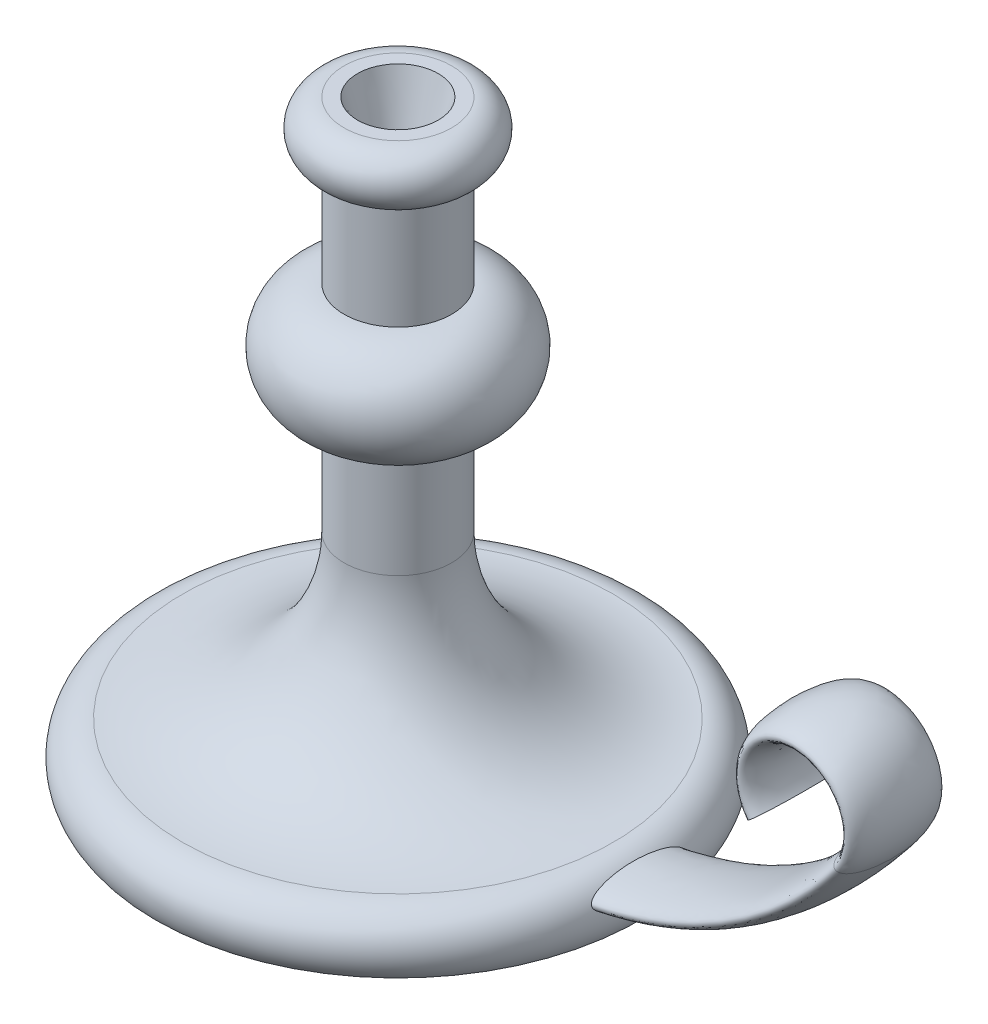
ISO-10303-21;
HEADER;
FILE_DESCRIPTION(('STEP AP214'),'2;1');
FILE_NAME('part.step','',(''),(''),'','','');
FILE_SCHEMA(('AUTOMOTIVE_DESIGN { 1 0 10303 214 1 1 1 1 }'));
ENDSEC;
DATA;
#1=APPLICATION_CONTEXT('core data for automotive mechanical design processes');
#2=APPLICATION_PROTOCOL_DEFINITION('international standard','automotive_design',2000,#1);
#3=PRODUCT_CONTEXT('',#1,'mechanical');
#4=PRODUCT('Part','Part','',(#3));
#5=PRODUCT_RELATED_PRODUCT_CATEGORY('part','',(#4));
#6=PRODUCT_DEFINITION_FORMATION('','',#4);
#7=PRODUCT_DEFINITION_CONTEXT('part definition',#1,'design');
#8=PRODUCT_DEFINITION('design','',#6,#7);
#9=PRODUCT_DEFINITION_SHAPE('','',#8);
#10=(LENGTH_UNIT() NAMED_UNIT(*) SI_UNIT(.MILLI.,.METRE.));
#11=(NAMED_UNIT(*) PLANE_ANGLE_UNIT() SI_UNIT($,.RADIAN.));
#12=(NAMED_UNIT(*) SI_UNIT($,.STERADIAN.) SOLID_ANGLE_UNIT());
#13=UNCERTAINTY_MEASURE_WITH_UNIT(LENGTH_MEASURE(1.E-05),#10,'distance_accuracy_value','');
#14=(GEOMETRIC_REPRESENTATION_CONTEXT(3) GLOBAL_UNCERTAINTY_ASSIGNED_CONTEXT((#13)) GLOBAL_UNIT_ASSIGNED_CONTEXT((#10,
#11,#12)) REPRESENTATION_CONTEXT('',''));
#15=CARTESIAN_POINT('',(0.,0.,0.));
#16=DIRECTION('',(0.,0.,1.));
#17=DIRECTION('',(1.,0.,0.));
#18=AXIS2_PLACEMENT_3D('',#15,#16,#17);
#19=CARTESIAN_POINT('',(90.,0.,0.));
#20=DIRECTION('',(0.,-1.,0.));
#21=DIRECTION('',(0.,0.,-1.));
#22=AXIS2_PLACEMENT_3D('',#19,#20,#21);
#23=PLANE('',#22);
#24=CARTESIAN_POINT('',(0.,0.,0.));
#25=DIRECTION('',(0.,-1.,0.));
#26=DIRECTION('',(0.,0.,-1.));
#27=AXIS2_PLACEMENT_3D('',#24,#25,#26);
#28=CIRCLE('',#27,90.);
#29=CARTESIAN_POINT('',(0.,0.,-90.));
#30=VERTEX_POINT('',#29);
#31=EDGE_CURVE('E77',#30,#30,#28,.T.);
#32=ORIENTED_EDGE('',*,*,#31,.T.);
#33=EDGE_LOOP('',(#32));
#34=FACE_BOUND('',#33,.T.);
#35=ADVANCED_FACE('F37',(#34),#23,.T.);
#36=CARTESIAN_POINT('',(0.,220.,0.));
#37=DIRECTION('',(0.,1.,0.));
#38=DIRECTION('',(0.,0.,1.));
#39=AXIS2_PLACEMENT_3D('',#36,#37,#38);
#40=PLANE('',#39);
#41=CARTESIAN_POINT('',(0.,220.,0.));
#42=DIRECTION('',(0.,1.,0.));
#43=DIRECTION('',(0.,0.,1.));
#44=AXIS2_PLACEMENT_3D('',#41,#42,#43);
#45=CIRCLE('',#44,15.);
#46=CARTESIAN_POINT('',(0.,220.,15.));
#47=VERTEX_POINT('',#46);
#48=EDGE_CURVE('E93',#47,#47,#45,.T.);
#49=ORIENTED_EDGE('',*,*,#48,.F.);
#50=EDGE_LOOP('',(#49));
#51=FACE_BOUND('',#50,.T.);
#52=CARTESIAN_POINT('',(0.,220.,0.));
#53=DIRECTION('',(0.,-1.,0.));
#54=DIRECTION('',(0.,0.,-1.));
#55=AXIS2_PLACEMENT_3D('',#52,#53,#54);
#56=CIRCLE('',#55,20.);
#57=CARTESIAN_POINT('',(0.,220.,-20.));
#58=VERTEX_POINT('',#57);
#59=EDGE_CURVE('E49',#58,#58,#56,.T.);
#60=ORIENTED_EDGE('',*,*,#59,.F.);
#61=EDGE_LOOP('',(#60));
#62=FACE_BOUND('',#61,.T.);
#63=ADVANCED_FACE('F100',(#51,#62),#40,.T.);
#64=CARTESIAN_POINT('',(0.,210.,0.));
#65=DIRECTION('',(0.,-1.,0.));
#66=DIRECTION('',(0.,0.,-1.));
#67=AXIS2_PLACEMENT_3D('',#64,#65,#66);
#68=TOROIDAL_SURFACE('',#67,20.,10.);
#69=ORIENTED_EDGE('',*,*,#59,.T.);
#70=EDGE_LOOP('',(#69));
#71=FACE_BOUND('',#70,.T.);
#72=CARTESIAN_POINT('',(0.,200.,0.));
#73=DIRECTION('',(0.,-1.,0.));
#74=DIRECTION('',(0.,0.,-1.));
#75=AXIS2_PLACEMENT_3D('',#72,#73,#74);
#76=CIRCLE('',#75,20.);
#77=CARTESIAN_POINT('',(0.,200.,-20.));
#78=VERTEX_POINT('',#77);
#79=EDGE_CURVE('E54',#78,#78,#76,.T.);
#80=ORIENTED_EDGE('',*,*,#79,.F.);
#81=EDGE_LOOP('',(#80));
#82=FACE_BOUND('',#81,.T.);
#83=ADVANCED_FACE('F103',(#71,#82),#68,.T.);
#84=CARTESIAN_POINT('',(0.,0.,0.));
#85=DIRECTION('',(0.,-1.,0.));
#86=DIRECTION('',(0.,0.,-1.));
#87=AXIS2_PLACEMENT_3D('',#84,#85,#86);
#88=CYLINDRICAL_SURFACE('',#87,20.);
#89=ORIENTED_EDGE('',*,*,#79,.T.);
#90=EDGE_LOOP('',(#89));
#91=FACE_BOUND('',#90,.T.);
#92=CARTESIAN_POINT('',(0.,160.,0.));
#93=DIRECTION('',(0.,-1.,0.));
#94=DIRECTION('',(0.,0.,-1.));
#95=AXIS2_PLACEMENT_3D('',#92,#93,#94);
#96=CIRCLE('',#95,20.);
#97=CARTESIAN_POINT('',(0.,160.,-20.));
#98=VERTEX_POINT('',#97);
#99=EDGE_CURVE('E59',#98,#98,#96,.T.);
#100=ORIENTED_EDGE('',*,*,#99,.F.);
#101=EDGE_LOOP('',(#100));
#102=FACE_BOUND('',#101,.T.);
#103=ADVANCED_FACE('F108',(#91,#102),#88,.T.);
#104=CARTESIAN_POINT('',(0.,140.,0.));
#105=DIRECTION('',(0.,-1.,0.));
#106=DIRECTION('',(0.,0.,-1.));
#107=AXIS2_PLACEMENT_3D('',#104,#105,#106);
#108=TOROIDAL_SURFACE('',#107,20.,20.);
#109=ORIENTED_EDGE('',*,*,#99,.T.);
#110=EDGE_LOOP('',(#109));
#111=FACE_BOUND('',#110,.T.);
#112=CARTESIAN_POINT('',(0.,120.,0.));
#113=DIRECTION('',(0.,-1.,0.));
#114=DIRECTION('',(0.,0.,-1.));
#115=AXIS2_PLACEMENT_3D('',#112,#113,#114);
#116=CIRCLE('',#115,20.);
#117=CARTESIAN_POINT('',(0.,120.,-20.));
#118=VERTEX_POINT('',#117);
#119=EDGE_CURVE('E65',#118,#118,#116,.T.);
#120=ORIENTED_EDGE('',*,*,#119,.F.);
#121=EDGE_LOOP('',(#120));
#122=FACE_BOUND('',#121,.T.);
#123=ADVANCED_FACE('F114',(#111,#122),#108,.T.);
#124=CARTESIAN_POINT('',(0.,0.,0.));
#125=DIRECTION('',(0.,-1.,0.));
#126=DIRECTION('',(0.,0.,-1.));
#127=AXIS2_PLACEMENT_3D('',#124,#125,#126);
#128=CYLINDRICAL_SURFACE('',#127,20.);
#129=ORIENTED_EDGE('',*,*,#119,.T.);
#130=EDGE_LOOP('',(#129));
#131=FACE_BOUND('',#130,.T.);
#132=CARTESIAN_POINT('',(0.,80.,0.));
#133=DIRECTION('',(0.,-1.,0.));
#134=DIRECTION('',(0.,0.,-1.));
#135=AXIS2_PLACEMENT_3D('',#132,#133,#134);
#136=CIRCLE('',#135,20.);
#137=CARTESIAN_POINT('',(0.,80.,-20.));
#138=VERTEX_POINT('',#137);
#139=EDGE_CURVE('E69',#138,#138,#136,.T.);
#140=ORIENTED_EDGE('',*,*,#139,.F.);
#141=EDGE_LOOP('',(#140));
#142=FACE_BOUND('',#141,.T.);
#143=ADVANCED_FACE('F118',(#131,#142),#128,.T.);
#144=CARTESIAN_POINT('',(0.,80.,0.));
#145=DIRECTION('',(0.,-1.,0.));
#146=DIRECTION('',(0.,0.,-1.));
#147=AXIS2_PLACEMENT_3D('',#144,#145,#146);
#148=TOROIDAL_SURFACE('',#147,80.,60.);
#149=ORIENTED_EDGE('',*,*,#139,.T.);
#150=EDGE_LOOP('',(#149));
#151=FACE_BOUND('',#150,.T.);
#152=CARTESIAN_POINT('',(0.,20.,0.));
#153=DIRECTION('',(0.,-1.,0.));
#154=DIRECTION('',(0.,0.,-1.));
#155=AXIS2_PLACEMENT_3D('',#152,#153,#154);
#156=CIRCLE('',#155,80.);
#157=CARTESIAN_POINT('',(0.,20.,-80.));
#158=VERTEX_POINT('',#157);
#159=EDGE_CURVE('E73',#158,#158,#156,.T.);
#160=ORIENTED_EDGE('',*,*,#159,.F.);
#161=EDGE_LOOP('',(#160));
#162=FACE_BOUND('',#161,.T.);
#163=ADVANCED_FACE('F122',(#151,#162),#148,.F.);
#164=CARTESIAN_POINT('',(0.,7.50000000000001,0.));
#165=DIRECTION('',(0.,-1.,0.));
#166=DIRECTION('',(0.,0.,-1.));
#167=AXIS2_PLACEMENT_3D('',#164,#165,#166);
#168=TOROIDAL_SURFACE('',#167,80.,12.5);
#169=CARTESIAN_POINT('',(89.5597422043342,12.9414346567555,17.5));
#170=CARTESIAN_POINT('',(89.5807278946485,12.8988393157081,17.5000019534777));
#171=CARTESIAN_POINT('',(89.6018125795404,12.8563039357769,17.4977816975197));
#172=CARTESIAN_POINT('',(89.6440155813562,12.7716938339371,17.489002543543));
#173=CARTESIAN_POINT('',(89.6651339056646,12.7296192360718,17.4824425050804));
#174=CARTESIAN_POINT('',(89.7283289297819,12.6045076597417,17.4565216692095));
#175=CARTESIAN_POINT('',(89.7702246464786,12.5226255894255,17.4309204730636));
#176=CARTESIAN_POINT('',(89.8644276523312,12.3407735771966,17.3563532007827));
#177=CARTESIAN_POINT('',(89.916211748319,12.242484901666,17.3027527423027));
#178=CARTESIAN_POINT('',(90.01638786814,12.0551458272008,17.178826321144));
#179=CARTESIAN_POINT('',(90.0647710548456,11.966119226993,17.1084587296403));
#180=CARTESIAN_POINT('',(90.1524531790238,11.806984522925,16.9652391551481));
#181=CARTESIAN_POINT('',(90.1921458014335,11.7358878994478,16.8936963434585));
#182=CARTESIAN_POINT('',(90.2690886261224,11.5996259068224,16.7438969488311));
#183=CARTESIAN_POINT('',(90.3063367280021,11.5344656201533,16.665634722265));
#184=CARTESIAN_POINT('',(90.3786756485819,11.4092540815106,16.5039763875565));
#185=CARTESIAN_POINT('',(90.4137624747614,11.349212210629,16.4205713158719));
#186=CARTESIAN_POINT('',(90.4819450166471,11.2336894025402,16.2499454917114));
#187=CARTESIAN_POINT('',(90.5150413047902,11.1782071523835,16.162725848809));
#188=CARTESIAN_POINT('',(90.5839705930101,11.063725182569,15.9728919395737));
#189=CARTESIAN_POINT('',(90.6195406839562,11.0053156128849,15.8698282905888));
#190=CARTESIAN_POINT('',(90.6886668526269,10.8929143897208,15.6606649910659));
#191=CARTESIAN_POINT('',(90.7222226971281,10.8389232475745,15.5545649910506));
#192=CARTESIAN_POINT('',(90.7874864861339,10.7348751403119,15.3401290691865));
#193=CARTESIAN_POINT('',(90.8191972688173,10.6848120890841,15.2317969483067));
#194=CARTESIAN_POINT('',(90.881005962979,10.5880683385414,15.0131968985225));
#195=CARTESIAN_POINT('',(90.9111039714558,10.5413874357517,14.9029290865687));
#196=CARTESIAN_POINT('',(90.9798973633521,10.4355491517099,14.6427529331226));
#197=CARTESIAN_POINT('',(91.0180072010883,10.377593665576,14.4922012075481));
#198=CARTESIAN_POINT('',(91.0918875553169,10.2663462891692,14.1888070722871));
#199=CARTESIAN_POINT('',(91.1276577411367,10.2130550577559,14.0359643425398));
#200=CARTESIAN_POINT('',(91.1971197458645,10.1105127689612,13.7282685712582));
#201=CARTESIAN_POINT('',(91.2308091946811,10.0612662985098,13.573413471871));
#202=CARTESIAN_POINT('',(91.2962483962878,9.966420445748,13.262180104172));
#203=CARTESIAN_POINT('',(91.3279980241889,9.92082129819994,13.1058017385396));
#204=CARTESIAN_POINT('',(91.4205951755327,9.78887458660799,12.6346162266685));
#205=CARTESIAN_POINT('',(91.4787589060981,9.70742476979596,12.3179025042442));
#206=CARTESIAN_POINT('',(91.5890957852254,9.55493826130153,11.6792188898602));
#207=CARTESIAN_POINT('',(91.641236506382,9.48395741425907,11.357230318611));
#208=CARTESIAN_POINT('',(91.7397682682944,9.35136221163198,10.7107316640823));
#209=CARTESIAN_POINT('',(91.7861636672357,9.28974074823248,10.3862236929834));
#210=CARTESIAN_POINT('',(91.873697660451,9.17463718318055,9.73512886653574));
#211=CARTESIAN_POINT('',(91.9148370779327,9.12115380666538,9.4085423451682));
#212=CARTESIAN_POINT('',(91.9930777751443,9.0203120992032,8.74630339912618));
#213=CARTESIAN_POINT('',(92.0300669877613,8.97311921137161,8.41061269264342));
#214=CARTESIAN_POINT('',(92.0991833927575,8.88559842477435,7.73783252743949));
#215=CARTESIAN_POINT('',(92.1313104056235,8.84527077946753,7.40074301754616));
#216=CARTESIAN_POINT('',(92.1909161961866,8.77092313439269,6.7253714235535));
#217=CARTESIAN_POINT('',(92.2183937480205,8.73690479789184,6.38708904887196));
#218=CARTESIAN_POINT('',(92.2688480816039,8.67476840304502,5.70964427774295));
#219=CARTESIAN_POINT('',(92.2918247141674,8.64665054027194,5.37048185250303));
#220=CARTESIAN_POINT('',(92.3540877228586,8.57076604630489,4.35367181244673));
#221=CARTESIAN_POINT('',(92.3868571977359,8.53128338370556,3.67498389641651));
#222=CARTESIAN_POINT('',(92.4356134743347,8.47274161832897,2.31614711504074));
#223=CARTESIAN_POINT('',(92.4515998737814,8.45368300509717,1.63599821506828));
#224=CARTESIAN_POINT('',(92.4661200478782,8.43637339284856,0.357955102331981));
#225=CARTESIAN_POINT('',(92.4665389208555,8.43587490179708,-0.239888856143625));
#226=CARTESIAN_POINT('',(92.4546362797528,8.45006241260831,-1.43536153859162));
#227=CARTESIAN_POINT('',(92.4423128974783,8.46475064105846,-2.0329902181484));
#228=CARTESIAN_POINT('',(92.4047541650815,8.50976680779931,-3.22745109478543));
#229=CARTESIAN_POINT('',(92.3795147316879,8.54009969200439,-3.82428298010724));
#230=CARTESIAN_POINT('',(92.3157217367252,8.61743320229677,-5.01694606233261));
#231=CARTESIAN_POINT('',(92.2771508465328,8.6644555239592,-5.61277493756131));
#232=CARTESIAN_POINT('',(92.1861026743767,8.77678784246257,-6.80153886380941));
#233=CARTESIAN_POINT('',(92.1336290020919,8.84209309262499,-7.39447462535093));
#234=CARTESIAN_POINT('',(92.0437550848418,8.95574227206712,-8.28055229820515));
#235=CARTESIAN_POINT('',(92.0119455213755,8.99622894552015,-8.57528682166729));
#236=CARTESIAN_POINT('',(91.9444204496405,9.0829153979489,-9.16346094428887));
#237=CARTESIAN_POINT('',(91.9087051114865,9.1291149281146,-9.45690059926718));
#238=CARTESIAN_POINT('',(91.8331309715697,9.2278292933407,-10.0422906036684));
#239=CARTESIAN_POINT('',(91.7932707518514,9.28034629056384,-10.3342404073468));
#240=CARTESIAN_POINT('',(91.7091179167369,9.39245062081632,-10.9161852811053));
#241=CARTESIAN_POINT('',(91.6648247441272,9.45203884286032,-11.2061801005453));
#242=CARTESIAN_POINT('',(91.5713925727481,9.57931645333882,-11.7838191658169));
#243=CARTESIAN_POINT('',(91.5222504482681,9.64701107336927,-12.0714617643073));
#244=CARTESIAN_POINT('',(91.4186796874406,9.79172730085908,-12.6430805537632));
#245=CARTESIAN_POINT('',(91.3642572573635,9.86873798424097,-12.9270606150355));
#246=CARTESIAN_POINT('',(91.2493765391174,10.033952974788,-13.4904217181466));
#247=CARTESIAN_POINT('',(91.1889212109096,10.1221517983454,-13.7698049377448));
#248=CARTESIAN_POINT('',(91.0929373870873,10.2648274882363,-14.1839125047647));
#249=CARTESIAN_POINT('',(91.0600757486262,10.314090418185,-14.3210581267387));
#250=CARTESIAN_POINT('',(90.9923938569386,10.4165511027192,-14.593376347765));
#251=CARTESIAN_POINT('',(90.9575737807135,10.4697485018484,-14.7285491237345));
#252=CARTESIAN_POINT('',(90.8810851838775,10.5878451344079,-15.0138774923678));
#253=CARTESIAN_POINT('',(90.8391147723957,10.6533666208412,-15.1636969104749));
#254=CARTESIAN_POINT('',(90.7519625692612,10.7912189771816,-15.4593295355901));
#255=CARTESIAN_POINT('',(90.7067794219568,10.8635527258308,-15.6051410149849));
#256=CARTESIAN_POINT('',(90.6128939496974,11.0160439629677,-15.8905749729623));
#257=CARTESIAN_POINT('',(90.5642084544311,11.0961646105686,-16.0302224467125));
#258=CARTESIAN_POINT('',(90.4624897667354,11.2662530107873,-16.3016394850687));
#259=CARTESIAN_POINT('',(90.4094613083908,11.3562100760682,-16.4334173639364));
#260=CARTESIAN_POINT('',(90.3114276481006,11.5255085385048,-16.6553108138959));
#261=CARTESIAN_POINT('',(90.2675273757817,11.6022608890606,-16.747864447136));
#262=CARTESIAN_POINT('',(90.1761749534326,11.7643292238687,-16.9236630994731));
#263=CARTESIAN_POINT('',(90.1287172073378,11.849658775493,-17.0068929161981));
#264=CARTESIAN_POINT('',(90.0292807633426,12.0313291797368,-17.160728121925));
#265=CARTESIAN_POINT('',(89.9772518064337,12.1277974407354,-17.2311575389091));
#266=CARTESIAN_POINT('',(89.8965437818878,12.2800613987942,-17.3212876850735));
#267=CARTESIAN_POINT('',(89.8692277989253,12.3320164153137,-17.3487242132161));
#268=CARTESIAN_POINT('',(89.8138320311431,12.4382955168478,-17.397521114568));
#269=CARTESIAN_POINT('',(89.7857527202501,12.4926181439798,-17.4188851676711));
#270=CARTESIAN_POINT('',(89.7185869780335,12.6237048005599,-17.4611772226903));
#271=CARTESIAN_POINT('',(89.6792533408886,12.7013692224277,-17.4790502108363));
#272=CARTESIAN_POINT('',(89.6005512815564,12.8586256339485,-17.4997317533413));
#273=CARTESIAN_POINT('',(89.5611829132233,12.9382160139949,-17.5025524785485));
#274=CARTESIAN_POINT('',(89.4835317885697,13.0969633423244,-17.4927372657774));
#275=CARTESIAN_POINT('',(89.4452490812936,13.1761202708964,-17.4801006306501));
#276=CARTESIAN_POINT('',(89.3707047667355,13.3318071774563,-17.440649407729));
#277=CARTESIAN_POINT('',(89.3344452993771,13.4083343423531,-17.4138201116179));
#278=CARTESIAN_POINT('',(89.2510611220235,13.5858554385683,-17.3357126521072));
#279=CARTESIAN_POINT('',(89.2050998650831,13.684982377722,-17.2790047620841));
#280=CARTESIAN_POINT('',(89.1180744174556,13.874427631182,-17.1491670423826));
#281=CARTESIAN_POINT('',(89.0770301058259,13.9647099356686,-17.0759737821298));
#282=CARTESIAN_POINT('',(89.0037033744711,14.1271434857571,-16.927057730704));
#283=CARTESIAN_POINT('',(88.9709541551903,14.2001945680732,-16.8525208708986));
#284=CARTESIAN_POINT('',(88.908496842619,14.3401811690449,-16.6970292692111));
#285=CARTESIAN_POINT('',(88.8787841266134,14.4071259665769,-16.6160846261893));
#286=CARTESIAN_POINT('',(88.8217814388549,14.5359995630883,-16.4490709627678));
#287=CARTESIAN_POINT('',(88.7944998605827,14.5979109242412,-16.362985782321));
#288=CARTESIAN_POINT('',(88.7420667437369,14.717173406466,-16.1870697873631));
#289=CARTESIAN_POINT('',(88.7169159331092,14.7745229686601,-16.0972377082951));
#290=CARTESIAN_POINT('',(88.6682699235336,14.8855899090512,-15.9140699306463));
#291=CARTESIAN_POINT('',(88.6447869137156,14.9392804489426,-15.8207148279059));
#292=CARTESIAN_POINT('',(88.5993971939427,15.0431008843882,-15.6316626961433));
#293=CARTESIAN_POINT('',(88.5774907604158,15.0932301555102,-15.5359652603525));
#294=CARTESIAN_POINT('',(88.513751478622,15.2390285874186,-15.2458062448787));
#295=CARTESIAN_POINT('',(88.4739596847913,15.3299685477359,-15.0485147207848));
#296=CARTESIAN_POINT('',(88.3985337506615,15.5017775203626,-14.6487152633388));
#297=CARTESIAN_POINT('',(88.3629029634839,15.5826384140041,-14.4462032813474));
#298=CARTESIAN_POINT('',(88.2948356711212,15.7363066128672,-14.036576470169));
#299=CARTESIAN_POINT('',(88.2624142295169,15.8090761199816,-13.829445054535));
#300=CARTESIAN_POINT('',(88.2003835751381,15.9473648801957,-13.412628987176));
#301=CARTESIAN_POINT('',(88.1707714189814,16.0128917338223,-13.2029472733582));
#302=CARTESIAN_POINT('',(88.1139049361937,16.1377375745621,-12.78149499463));
#303=CARTESIAN_POINT('',(88.0866500408508,16.1970580597504,-12.5697249473627));
#304=CARTESIAN_POINT('',(88.0276172572029,16.3244235662305,-12.0912931700777));
#305=CARTESIAN_POINT('',(87.9964138193044,16.3909381265495,-11.8241540502343));
#306=CARTESIAN_POINT('',(87.9367717636617,16.5165936764721,-11.2878278414647));
#307=CARTESIAN_POINT('',(87.9083334164421,16.5757339447661,-11.0186405549271));
#308=CARTESIAN_POINT('',(87.8539266282972,16.6875098948958,-10.478540842488));
#309=CARTESIAN_POINT('',(87.8279593730487,16.7401424577996,-10.207627654319));
#310=CARTESIAN_POINT('',(87.7783184309331,16.8395301522937,-9.66451167999793));
#311=CARTESIAN_POINT('',(87.7546448506396,16.8862850108119,-9.39230883453888));
#312=CARTESIAN_POINT('',(87.6869994555324,17.0182803050949,-8.5757896592175));
#313=CARTESIAN_POINT('',(87.6462388525846,17.0955854003688,-8.02991167225412));
#314=CARTESIAN_POINT('',(87.5728065515611,17.2320145687303,-6.93552385093954));
#315=CARTESIAN_POINT('',(87.5401330675682,17.2911426566328,-6.3870146249804));
#316=CARTESIAN_POINT('',(87.4828441952971,17.3930876120975,-5.2895588485085));
#317=CARTESIAN_POINT('',(87.458207458868,17.4359477429323,-4.74061740412501));
#318=CARTESIAN_POINT('',(87.4169410999172,17.5068884934702,-3.64146108218688));
#319=CARTESIAN_POINT('',(87.4003119088602,17.5349683167839,-3.09124613761779));
#320=CARTESIAN_POINT('',(87.3751699481989,17.5771566462025,-1.98980868969207));
#321=CARTESIAN_POINT('',(87.3666614689743,17.5912577671532,-1.43858580772119));
#322=CARTESIAN_POINT('',(87.3578539704596,17.6058511840596,-0.335909067645513));
#323=CARTESIAN_POINT('',(87.3575547550007,17.6063438052041,0.215544784625117));
#324=CARTESIAN_POINT('',(87.3651677510508,17.5937352162513,1.31815822776222));
#325=CARTESIAN_POINT('',(87.3730787250644,17.5806360547996,1.86931785045072));
#326=CARTESIAN_POINT('',(87.3970372477742,17.5404868292747,2.97097544677701));
#327=CARTESIAN_POINT('',(87.4130850653538,17.513436304176,3.52147339794715));
#328=CARTESIAN_POINT('',(87.4531996813081,17.4446213827576,4.62112135666769));
#329=CARTESIAN_POINT('',(87.4772644593791,17.402860693302,5.1702716687412));
#330=CARTESIAN_POINT('',(87.5333316774061,17.3033707612731,6.2667005362351));
#331=CARTESIAN_POINT('',(87.5653334299481,17.2456429015516,6.8139792495936));
#332=CARTESIAN_POINT('',(87.6208220531231,17.1429049509084,7.65503321383743));
#333=CARTESIAN_POINT('',(87.641467966926,17.104233324674,7.9497802880887));
#334=CARTESIAN_POINT('',(87.6851649593456,17.0212250701554,8.5382946276221));
#335=CARTESIAN_POINT('',(87.7082159678751,16.9768886069427,8.83206192119887));
#336=CARTESIAN_POINT('',(87.7568106691337,16.8820510369679,9.4182719723688));
#337=CARTESIAN_POINT('',(87.7823533406001,16.8315524537745,9.7107152216483));
#338=CARTESIAN_POINT('',(87.8360989952265,16.7237193681049,10.2940938312751));
#339=CARTESIAN_POINT('',(87.8643018909557,16.6663850902741,10.5850292408476));
#340=CARTESIAN_POINT('',(87.9147712499547,16.5622842610504,11.0784529887224));
#341=CARTESIAN_POINT('',(87.9362980252954,16.517469189979,11.2814293835336));
#342=CARTESIAN_POINT('',(87.9809118301304,16.4236835134751,11.6862455623077));
#343=CARTESIAN_POINT('',(88.0039988123353,16.3747130339803,11.8880853805192));
#344=CARTESIAN_POINT('',(88.0519198244943,16.272121538476,12.2905621648844));
#345=CARTESIAN_POINT('',(88.0767553337324,16.218496575543,12.4911979528414));
#346=CARTESIAN_POINT('',(88.1283787004668,16.1060707847339,12.8907612736838));
#347=CARTESIAN_POINT('',(88.1551664933022,16.0472701282664,13.089688862902));
#348=CARTESIAN_POINT('',(88.2109999780504,15.9237718205576,13.485420123141));
#349=CARTESIAN_POINT('',(88.2400459194858,15.8590735174965,13.682223556701));
#350=CARTESIAN_POINT('',(88.3008027999433,15.7228691935853,14.0730419872897));
#351=CARTESIAN_POINT('',(88.3325134779584,15.6513638393844,14.2670572552401));
#352=CARTESIAN_POINT('',(88.399142454196,15.5003948115859,14.6511973591138));
#353=CARTESIAN_POINT('',(88.4340575115816,15.4209391715426,14.8413258930661));
#354=CARTESIAN_POINT('',(88.5079196083049,15.2523848762565,15.2164401400171));
#355=CARTESIAN_POINT('',(88.546864811413,15.1632906117649,15.4014281468493));
#356=CARTESIAN_POINT('',(88.6092096238852,15.0206579718869,15.6733114229644));
#357=CARTESIAN_POINT('',(88.6306485895102,14.9716086740024,15.7630166800372));
#358=CARTESIAN_POINT('',(88.6750422753313,14.8701248615221,15.9401002079374));
#359=CARTESIAN_POINT('',(88.6979967332497,14.8176909327198,16.02747887776));
#360=CARTESIAN_POINT('',(88.7456840101799,14.7089478844274,16.1993887567134));
#361=CARTESIAN_POINT('',(88.770417968827,14.6526362825892,16.2839180892543));
#362=CARTESIAN_POINT('',(88.8219484857479,14.5356422617905,16.4492391224753));
#363=CARTESIAN_POINT('',(88.8487445345048,14.4749609227744,16.530031738603));
#364=CARTESIAN_POINT('',(88.8976102788187,14.3647434848949,16.666716843305));
#365=CARTESIAN_POINT('',(88.919137419161,14.316323032208,16.7236955334945));
#366=CARTESIAN_POINT('',(88.9637080676469,14.2164452982158,16.8342912802673));
#367=CARTESIAN_POINT('',(88.9867519478514,14.1649872721063,16.8879075056817));
#368=CARTESIAN_POINT('',(89.0583610181501,14.0058008216797,17.0423310846555));
#369=CARTESIAN_POINT('',(89.1095289234105,13.8929758416956,17.1370796109724));
#370=CARTESIAN_POINT('',(89.1999001554575,13.6963386208974,17.2707956184665));
#371=CARTESIAN_POINT('',(89.2367505169322,13.6167644879682,17.317550348063));
#372=CARTESIAN_POINT('',(89.3136877653851,13.4522974166011,17.3968468737186));
#373=CARTESIAN_POINT('',(89.3537667767867,13.3674175273965,17.4294220837181));
#374=CARTESIAN_POINT('',(89.4217091217894,13.2251848973541,17.4685967336683));
#375=CARTESIAN_POINT('',(89.448809384098,13.1688551716176,17.4803204652976));
#376=CARTESIAN_POINT('',(89.5037947740349,13.0554594934971,17.4960211898048));
#377=CARTESIAN_POINT('',(89.5316799819,12.9983934661741,17.499997387795));
#378=CARTESIAN_POINT('',(89.5597422043342,12.9414346567555,17.5));
#379=B_SPLINE_CURVE_WITH_KNOTS('',3,(#169,#170,#171,#172,#173,#174,#175,#176,#177,#178,#179,
#180,#181,#182,#183,#184,#185,#186,#187,#188,#189,#190,#191,#192,#193,#194,#195,#196,#197,#198,
#199,#200,#201,#202,#203,#204,#205,#206,#207,#208,#209,#210,#211,#212,#213,#214,#215,#216,#217,
#218,#219,#220,#221,#222,#223,#224,#225,#226,#227,#228,#229,#230,#231,#232,#233,#234,#235,#236,
#237,#238,#239,#240,#241,#242,#243,#244,#245,#246,#247,#248,#249,#250,#251,#252,#253,#254,#255,
#256,#257,#258,#259,#260,#261,#262,#263,#264,#265,#266,#267,#268,#269,#270,#271,#272,#273,#274,
#275,#276,#277,#278,#279,#280,#281,#282,#283,#284,#285,#286,#287,#288,#289,#290,#291,#292,#293,
#294,#295,#296,#297,#298,#299,#300,#301,#302,#303,#304,#305,#306,#307,#308,#309,#310,#311,#312,
#313,#314,#315,#316,#317,#318,#319,#320,#321,#322,#323,#324,#325,#326,#327,#328,#329,#330,#331,
#332,#333,#334,#335,#336,#337,#338,#339,#340,#341,#342,#343,#344,#345,#346,#347,#348,#349,#350,
#351,#352,#353,#354,#355,#356,#357,#358,#359,#360,#361,#362,#363,#364,#365,#366,#367,#368,#369,
#370,#371,#372,#373,#374,#375,#376,#377,#378),.UNSPECIFIED.,.T.,.F.,(4,2,2,2,2,2,2,2,2,2,2,2,2,
2,2,2,2,2,2,2,2,2,2,2,2,2,2,2,2,2,2,2,2,2,2,2,2,2,2,2,2,2,2,2,2,2,2,2,2,2,2,2,2,2,2,2,2,2,2,2,2,
2,2,2,2,2,2,2,2,2,2,2,2,2,2,2,2,2,2,2,2,2,2,2,2,2,2,2,2,2,2,2,2,2,2,2,2,2,2,2,2,2,2,2,4),(0.,
0.142381357158826,0.284800145338806,0.569778369710388,0.937790990160498,1.306726997976,
1.6314335332855,1.95641550824166,2.28198085179471,2.60745211744525,2.97835758825743,
3.34930592253138,3.7196676759357,4.0900071293106,4.58717127025772,5.08440552627599,
5.58219609730416,6.080018683222,7.07612740491144,8.07737111401412,9.07785060328473,
10.0781732018629,11.1010679437462,12.1240004418369,13.1472022244407,14.1704379160042,
16.2117115539474,18.2530341182272,20.0462457692419,21.839720367684,23.6337623045227,
25.4301450150665,27.2260617741975,28.1235892294177,29.0210776087004,29.9188740333847,
30.8167834514322,31.7152755049921,32.6127240115718,33.5097343419004,33.9578247270816,
34.405874679233,34.9121604747938,35.4186611861169,35.9228725276491,36.4265413835618,
36.8100240505595,37.1941231504199,37.5831580539592,37.7772586450041,37.9712413599168,
38.2366258142317,38.50179565338,38.766977452507,39.0324346081148,39.3996555983548,
39.7683144393121,40.095986637524,40.4231523204128,40.7514069982212,41.0797733710077,
41.4103344436379,41.7409533344653,42.4030339566271,43.0656444835733,43.7312306850952,
44.3961116446156,45.0608317450504,45.8918608553079,46.7229711882501,47.5544783139757,
48.3860240564151,50.0440426041177,51.7016946763012,53.3549069476187,55.0082082878452,
56.6623826267335,58.3165174374179,59.9704029618922,61.6243431428203,63.2778668395634,
64.9312473761669,65.8251617717407,66.7190501248694,67.6125736254212,68.5060677696838,
69.1329546330668,69.7598225042295,70.3872272415092,71.0146112082214,71.6420645989514,
72.2694566030659,72.8962209263452,73.5227009279518,73.8360175198394,74.1492800292299,
74.4627449766595,74.7761327179492,75.0094189443191,75.2427626113342,75.7080186392218,
76.0052441465113,76.3017654013241,76.4921392885518,76.6825327068868),.UNSPECIFIED.);
#380=CARTESIAN_POINT('',(89.5597422043342,12.9414346567555,17.5));
#381=VERTEX_POINT('',#380);
#382=EDGE_CURVE('E10',#381,#381,#379,.T.);
#383=ORIENTED_EDGE('',*,*,#382,.F.);
#384=EDGE_LOOP('',(#383));
#385=FACE_BOUND('',#384,.T.);
#386=ORIENTED_EDGE('',*,*,#159,.T.);
#387=EDGE_LOOP('',(#386));
#388=FACE_BOUND('',#387,.T.);
#389=ORIENTED_EDGE('',*,*,#31,.F.);
#390=EDGE_LOOP('',(#389));
#391=FACE_BOUND('',#390,.T.);
#392=ADVANCED_FACE('F125',(#385,#388,#391),#168,.T.);
#393=CARTESIAN_POINT('',(148.,70.,0.));
#394=DIRECTION('',(0.6,-0.8,0.));
#395=DIRECTION('',(0.,0.,-1.));
#396=AXIS2_PLACEMENT_3D('',#393,#394,#395);
#397=PLANE('',#396);
#398=CARTESIAN_POINT('',(148.,70.,0.));
#399=DIRECTION('',(0.6,-0.8,0.));
#400=DIRECTION('',(0.,0.,1.));
#401=AXIS2_PLACEMENT_3D('',#398,#399,#400);
#402=ELLIPSE('',#401,17.5,5.);
#403=CARTESIAN_POINT('',(148.,70.,17.5));
#404=VERTEX_POINT('',#403);
#405=EDGE_CURVE('E81',#404,#404,#402,.T.);
#406=ORIENTED_EDGE('',*,*,#405,.T.);
#407=EDGE_LOOP('',(#406));
#408=FACE_BOUND('',#407,.T.);
#409=ADVANCED_FACE('F130',(#408),#397,.T.);
#410=CARTESIAN_POINT('',(60.,10.,17.5));
#411=CARTESIAN_POINT('',(108.107236977278,10.,17.5));
#412=CARTESIAN_POINT('',(151.135657813633,31.5142104181772,17.5));
#413=CARTESIAN_POINT('',(180.,70.,17.5));
#414=CARTESIAN_POINT('',(60.,0.,17.5));
#415=CARTESIAN_POINT('',(111.314386109097,0.,17.5));
#416=CARTESIAN_POINT('',(157.211368334542,22.9484911127224,17.5));
#417=CARTESIAN_POINT('',(188.,64.,17.5));
#418=CARTESIAN_POINT('',(60.,0.,-17.5));
#419=CARTESIAN_POINT('',(111.314386109097,0.,-17.5));
#420=CARTESIAN_POINT('',(157.211368334542,22.9484911127224,-17.5));
#421=CARTESIAN_POINT('',(188.,64.,-17.5));
#422=CARTESIAN_POINT('',(60.,10.,-17.5));
#423=CARTESIAN_POINT('',(108.107236977278,10.,-17.5));
#424=CARTESIAN_POINT('',(151.135657813633,31.5142104181772,-17.5));
#425=CARTESIAN_POINT('',(180.,70.,-17.5));
#426=CARTESIAN_POINT('',(60.,20.,-17.5));
#427=CARTESIAN_POINT('',(104.90008784546,20.,-17.5));
#428=CARTESIAN_POINT('',(145.059947292724,40.0799297236321,-17.5));
#429=CARTESIAN_POINT('',(172.,76.,-17.5));
#430=CARTESIAN_POINT('',(60.,20.,17.5));
#431=CARTESIAN_POINT('',(104.90008784546,20.,17.5));
#432=CARTESIAN_POINT('',(145.059947292724,40.0799297236321,17.5));
#433=CARTESIAN_POINT('',(172.,76.,17.5));
#434=CARTESIAN_POINT('',(60.,10.,17.5));
#435=CARTESIAN_POINT('',(108.107236977278,10.,17.5));
#436=CARTESIAN_POINT('',(151.135657813633,31.5142104181772,17.5));
#437=CARTESIAN_POINT('',(180.,70.,17.5));
#438=(BOUNDED_SURFACE() B_SPLINE_SURFACE(3,3,((#410,#411,#412,#413),(#414,#415,#416,#417),(#418,
#419,#420,#421),(#422,#423,#424,#425),(#426,#427,#428,#429),(#430,#431,#432,#433),(#434,#435,
#436,#437)),.UNSPECIFIED.,.T.,.F.,.F.) B_SPLINE_SURFACE_WITH_KNOTS((4,3,4),(4,4),(0.,0.5,1.),
(0.,1.),.UNSPECIFIED.) GEOMETRIC_REPRESENTATION_ITEM() RATIONAL_B_SPLINE_SURFACE(((1.,
0.929618127333277,0.929618127333277,1.),(0.333333333333333,0.309872709111092,0.309872709111092,
0.333333333333333),(0.333333333333333,0.309872709111092,0.309872709111092,0.333333333333333),
(1.,0.929618127333277,0.929618127333277,1.),(0.333333333333333,0.309872709111092,
0.309872709111092,0.333333333333333),(0.333333333333333,0.309872709111092,0.309872709111092,
0.333333333333333),(1.,0.929618127333277,0.929618127333277,1.))) REPRESENTATION_ITEM('') SURFACE());
#439=CARTESIAN_POINT('',(180.,70.,0.));
#440=DIRECTION('',(0.6,0.8,0.));
#441=DIRECTION('',(0.,0.,1.));
#442=AXIS2_PLACEMENT_3D('',#439,#440,#441);
#443=ELLIPSE('',#442,17.5,5.);
#444=CARTESIAN_POINT('',(180.,70.,17.5));
#445=VERTEX_POINT('',#444);
#446=EDGE_CURVE('E85',#445,#445,#443,.T.);
#447=ORIENTED_EDGE('',*,*,#382,.T.);
#448=EDGE_LOOP('',(#447));
#449=FACE_BOUND('',#448,.T.);
#450=ORIENTED_EDGE('',*,*,#446,.F.);
#451=EDGE_LOOP('',(#450));
#452=FACE_BOUND('',#451,.T.);
#453=ADVANCED_FACE('F135',(#449,#452),#438,.T.);
#454=CARTESIAN_POINT('',(180.,70.,17.5));
#455=CARTESIAN_POINT('',(191.33126291999,85.1083505599865,17.5));
#456=CARTESIAN_POINT('',(182.885438199983,102.,17.5));
#457=CARTESIAN_POINT('',(164.,102.,17.5));
#458=CARTESIAN_POINT('',(145.114561800017,102.,17.5));
#459=CARTESIAN_POINT('',(136.66873708001,85.1083505599866,17.5));
#460=CARTESIAN_POINT('',(148.,70.,17.5));
#461=CARTESIAN_POINT('',(188.,64.,17.5));
#462=CARTESIAN_POINT('',(204.996894379985,86.6625258399798,17.5));
#463=CARTESIAN_POINT('',(192.328157299975,112.,17.5));
#464=CARTESIAN_POINT('',(164.,112.,17.5));
#465=CARTESIAN_POINT('',(135.671842700025,112.,17.5));
#466=CARTESIAN_POINT('',(123.003105620015,86.6625258399798,17.5));
#467=CARTESIAN_POINT('',(140.,64.,17.5));
#468=CARTESIAN_POINT('',(188.,64.,-17.5));
#469=CARTESIAN_POINT('',(204.996894379985,86.6625258399798,-17.5));
#470=CARTESIAN_POINT('',(192.328157299975,112.,-17.5));
#471=CARTESIAN_POINT('',(164.,112.,-17.5));
#472=CARTESIAN_POINT('',(135.671842700025,112.,-17.5));
#473=CARTESIAN_POINT('',(123.003105620015,86.6625258399798,-17.5));
#474=CARTESIAN_POINT('',(140.,64.,-17.5));
#475=CARTESIAN_POINT('',(180.,70.,-17.5));
#476=CARTESIAN_POINT('',(191.33126291999,85.1083505599865,-17.5));
#477=CARTESIAN_POINT('',(182.885438199983,102.,-17.5));
#478=CARTESIAN_POINT('',(164.,102.,-17.5));
#479=CARTESIAN_POINT('',(145.114561800017,102.,-17.5));
#480=CARTESIAN_POINT('',(136.66873708001,85.1083505599866,-17.5));
#481=CARTESIAN_POINT('',(148.,70.,-17.5));
#482=CARTESIAN_POINT('',(172.,76.,-17.5));
#483=CARTESIAN_POINT('',(177.665631459995,83.5541752799933,-17.5));
#484=CARTESIAN_POINT('',(173.442719099992,92.,-17.5));
#485=CARTESIAN_POINT('',(164.,92.,-17.5));
#486=CARTESIAN_POINT('',(154.557280900008,92.,-17.5));
#487=CARTESIAN_POINT('',(150.334368540005,83.5541752799932,-17.5));
#488=CARTESIAN_POINT('',(156.,76.,-17.5));
#489=CARTESIAN_POINT('',(172.,76.,17.5));
#490=CARTESIAN_POINT('',(177.665631459995,83.5541752799933,17.5));
#491=CARTESIAN_POINT('',(173.442719099992,92.,17.5));
#492=CARTESIAN_POINT('',(164.,92.,17.5));
#493=CARTESIAN_POINT('',(154.557280900008,92.,17.5));
#494=CARTESIAN_POINT('',(150.334368540005,83.5541752799932,17.5));
#495=CARTESIAN_POINT('',(156.,76.,17.5));
#496=CARTESIAN_POINT('',(180.,70.,17.5));
#497=CARTESIAN_POINT('',(191.33126291999,85.1083505599865,17.5));
#498=CARTESIAN_POINT('',(182.885438199983,102.,17.5));
#499=CARTESIAN_POINT('',(164.,102.,17.5));
#500=CARTESIAN_POINT('',(145.114561800017,102.,17.5));
#501=CARTESIAN_POINT('',(136.66873708001,85.1083505599866,17.5));
#502=CARTESIAN_POINT('',(148.,70.,17.5));
#503=(BOUNDED_SURFACE() B_SPLINE_SURFACE(3,3,((#454,#455,#456,#457,#458,#459,#460),(#461,#462,
#463,#464,#465,#466,#467),(#468,#469,#470,#471,#472,#473,#474),(#475,#476,#477,#478,#479,#480,
#481),(#482,#483,#484,#485,#486,#487,#488),(#489,#490,#491,#492,#493,#494,#495),(#496,#497,#498,
#499,#500,#501,#502)),.UNSPECIFIED.,.T.,.F.,.F.) B_SPLINE_SURFACE_WITH_KNOTS((4,3,4),(4,3,4),
(0.,0.5,1.),(0.,0.5,1.),
.UNSPECIFIED.) GEOMETRIC_REPRESENTATION_ITEM() RATIONAL_B_SPLINE_SURFACE(((1.,0.631475730333305,
0.631475730333305,1.,0.631475730333305,0.631475730333305,1.),(0.333333333333333,
0.210491910111102,0.210491910111102,0.333333333333333,0.210491910111102,0.210491910111102,
0.333333333333333),(0.333333333333333,0.210491910111102,0.210491910111102,0.333333333333333,
0.210491910111102,0.210491910111102,0.333333333333333),(1.,0.631475730333305,0.631475730333305,
1.,0.631475730333305,0.631475730333305,1.),(0.333333333333333,0.210491910111102,
0.210491910111102,0.333333333333333,0.210491910111102,0.210491910111102,0.333333333333333),
(0.333333333333333,0.210491910111102,0.210491910111102,0.333333333333333,0.210491910111102,
0.210491910111102,0.333333333333333),(1.,0.631475730333305,0.631475730333305,1.,
0.631475730333305,0.631475730333305,1.))) REPRESENTATION_ITEM('') SURFACE());
#504=ORIENTED_EDGE('',*,*,#405,.F.);
#505=EDGE_LOOP('',(#504));
#506=FACE_BOUND('',#505,.T.);
#507=ORIENTED_EDGE('',*,*,#446,.T.);
#508=EDGE_LOOP('',(#507));
#509=FACE_BOUND('',#508,.T.);
#510=ADVANCED_FACE('F132',(#506,#509),#503,.T.);
#511=CARTESIAN_POINT('',(0.,220.,0.));
#512=DIRECTION('',(0.,1.,0.));
#513=DIRECTION('',(0.,0.,1.));
#514=AXIS2_PLACEMENT_3D('',#511,#512,#513);
#515=CONICAL_SURFACE('',#514,15.,0.26179938779915);
#516=CARTESIAN_POINT('',(0.,195.,0.));
#517=DIRECTION('',(0.,1.,0.));
#518=DIRECTION('',(0.,0.,1.));
#519=AXIS2_PLACEMENT_3D('',#516,#517,#518);
#520=CIRCLE('',#519,8.30127018922192);
#521=CARTESIAN_POINT('',(0.,195.,8.30127018922192));
#522=VERTEX_POINT('',#521);
#523=EDGE_CURVE('E89',#522,#522,#520,.T.);
#524=ORIENTED_EDGE('',*,*,#523,.F.);
#525=EDGE_LOOP('',(#524));
#526=FACE_BOUND('',#525,.T.);
#527=ORIENTED_EDGE('',*,*,#48,.T.);
#528=EDGE_LOOP('',(#527));
#529=FACE_BOUND('',#528,.T.);
#530=ADVANCED_FACE('F98',(#526,#529),#515,.F.);
#531=CARTESIAN_POINT('',(0.,195.,0.));
#532=DIRECTION('',(0.,1.,0.));
#533=DIRECTION('',(0.,0.,1.));
#534=AXIS2_PLACEMENT_3D('',#531,#532,#533);
#535=PLANE('',#534);
#536=ORIENTED_EDGE('',*,*,#523,.T.);
#537=EDGE_LOOP('',(#536));
#538=FACE_BOUND('',#537,.T.);
#539=ADVANCED_FACE('F158',(#538),#535,.T.);
#540=CLOSED_SHELL('',(#35,#63,#83,#103,#123,#143,#163,#392,#409,#453,#510,#530,#539));
#541=MANIFOLD_SOLID_BREP('B2',#540);
#542=ADVANCED_BREP_SHAPE_REPRESENTATION('',(#18,#541),#14);
#543=SHAPE_DEFINITION_REPRESENTATION(#9,#542);
ENDSEC;
END-ISO-10303-21;
